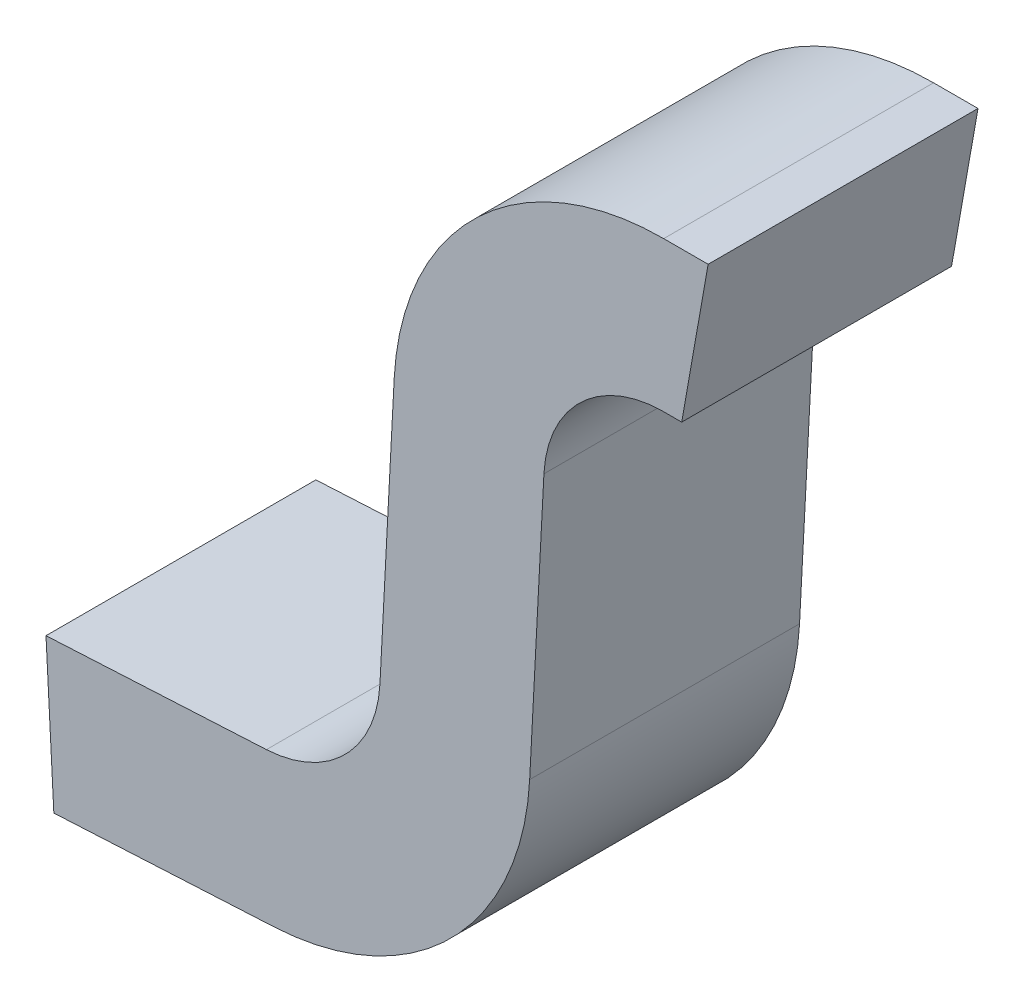
ISO-10303-21;
HEADER;
FILE_DESCRIPTION(('STEP AP214'),'2;1');
FILE_NAME('part.step','',(''),(''),'','','');
FILE_SCHEMA(('AUTOMOTIVE_DESIGN { 1 0 10303 214 1 1 1 1 }'));
ENDSEC;
DATA;
#1=APPLICATION_CONTEXT('core data for automotive mechanical design processes');
#2=APPLICATION_PROTOCOL_DEFINITION('international standard','automotive_design',2000,#1);
#3=PRODUCT_CONTEXT('',#1,'mechanical');
#4=PRODUCT('Part','Part','',(#3));
#5=PRODUCT_RELATED_PRODUCT_CATEGORY('part','',(#4));
#6=PRODUCT_DEFINITION_FORMATION('','',#4);
#7=PRODUCT_DEFINITION_CONTEXT('part definition',#1,'design');
#8=PRODUCT_DEFINITION('design','',#6,#7);
#9=PRODUCT_DEFINITION_SHAPE('','',#8);
#10=(LENGTH_UNIT() NAMED_UNIT(*) SI_UNIT(.MILLI.,.METRE.));
#11=(NAMED_UNIT(*) PLANE_ANGLE_UNIT() SI_UNIT($,.RADIAN.));
#12=(NAMED_UNIT(*) SI_UNIT($,.STERADIAN.) SOLID_ANGLE_UNIT());
#13=UNCERTAINTY_MEASURE_WITH_UNIT(LENGTH_MEASURE(1.E-05),#10,'distance_accuracy_value','');
#14=(GEOMETRIC_REPRESENTATION_CONTEXT(3) GLOBAL_UNCERTAINTY_ASSIGNED_CONTEXT((#13)) GLOBAL_UNIT_ASSIGNED_CONTEXT((#10,
#11,#12)) REPRESENTATION_CONTEXT('',''));
#15=CARTESIAN_POINT('',(0.,0.,0.));
#16=DIRECTION('',(0.,0.,1.));
#17=DIRECTION('',(1.,0.,0.));
#18=AXIS2_PLACEMENT_3D('',#15,#16,#17);
#19=CARTESIAN_POINT('',(0.,0.,-1.1875));
#20=DIRECTION('',(0.,0.,-1.));
#21=DIRECTION('',(-1.,0.,0.));
#22=AXIS2_PLACEMENT_3D('',#19,#20,#21);
#23=PLANE('',#22);
#24=DIRECTION('',(0.0523359562429177,0.998629534754575,0.));
#25=VECTOR('',#24,1.);
#26=CARTESIAN_POINT('',(-0.861573213012,-0.31493822705,-1.1875));
#27=LINE('',#26,#25);
#28=CARTESIAN_POINT('',(-0.849691645319655,-0.0882244098453541,-1.1875));
#29=VERTEX_POINT('',#28);
#30=CARTESIAN_POINT('',(-0.861573213012008,-0.31493822705016,-1.1875));
#31=VERTEX_POINT('',#30);
#32=EDGE_CURVE('E145',#29,#31,#27,.F.);
#33=ORIENTED_EDGE('',*,*,#32,.T.);
#34=CARTESIAN_POINT('',(-0.961436166488,-0.309704631426,-1.1875));
#35=DIRECTION('',(0.,0.,-1.));
#36=DIRECTION('',(-1.,0.,0.));
#37=AXIS2_PLACEMENT_3D('',#34,#35,#36);
#38=CIRCLE('',#37,0.1);
#39=CARTESIAN_POINT('',(-0.956202570863354,-0.40956758490123,-1.1875));
#40=VERTEX_POINT('',#39);
#41=EDGE_CURVE('E181',#31,#40,#38,.T.);
#42=ORIENTED_EDGE('',*,*,#41,.T.);
#43=DIRECTION('',(0.998629534754575,0.0523359562429177,0.));
#44=VECTOR('',#43,1.);
#45=CARTESIAN_POINT('',(-1.14,-0.4192,-1.1875));
#46=LINE('',#45,#44);
#47=CARTESIAN_POINT('',(-1.14000000000012,-0.419200000000006,-1.1875));
#48=VERTEX_POINT('',#47);
#49=EDGE_CURVE('E149',#40,#48,#46,.F.);
#50=ORIENTED_EDGE('',*,*,#49,.T.);
#51=DIRECTION('',(-0.0523359562429177,0.998629534754575,0.));
#52=VECTOR('',#51,1.);
#53=CARTESIAN_POINT('',(-1.13345800547,-0.544028691844,-1.1875));
#54=LINE('',#53,#52);
#55=CARTESIAN_POINT('',(-1.13345800547,-0.544028691843999,-1.1875));
#56=VERTEX_POINT('',#55);
#57=EDGE_CURVE('E155',#48,#56,#54,.F.);
#58=ORIENTED_EDGE('',*,*,#57,.T.);
#59=DIRECTION('',(-0.998629534754575,-0.0523359562429177,0.));
#60=VECTOR('',#59,1.);
#61=CARTESIAN_POINT('',(-0.949660576333,-0.534396276745,-1.1875));
#62=LINE('',#61,#60);
#63=CARTESIAN_POINT('',(-0.949660576333192,-0.53439627674501,-1.1875));
#64=VERTEX_POINT('',#63);
#65=EDGE_CURVE('E160',#56,#64,#62,.F.);
#66=ORIENTED_EDGE('',*,*,#65,.T.);
#67=CARTESIAN_POINT('',(-0.961436166488,-0.309704631426,-1.1875));
#68=DIRECTION('',(0.,0.,-1.));
#69=DIRECTION('',(-1.,0.,0.));
#70=AXIS2_PLACEMENT_3D('',#67,#68,#69);
#71=CIRCLE('',#70,0.225);
#72=CARTESIAN_POINT('',(-0.736744521168336,-0.321480221580316,-1.1875));
#73=VERTEX_POINT('',#72);
#74=EDGE_CURVE('E108',#73,#64,#71,.T.);
#75=ORIENTED_EDGE('',*,*,#74,.F.);
#76=DIRECTION('',(-0.0523359562429177,-0.998629534754575,0.));
#77=VECTOR('',#76,1.);
#78=CARTESIAN_POINT('',(-0.724862953476,-0.09476640437571,-1.1875));
#79=LINE('',#78,#77);
#80=CARTESIAN_POINT('',(-0.724862953475999,-0.0947664043756949,-1.1875));
#81=VERTEX_POINT('',#80);
#82=EDGE_CURVE('E103',#73,#81,#79,.F.);
#83=ORIENTED_EDGE('',*,*,#82,.T.);
#84=CARTESIAN_POINT('',(-0.625,-0.1,-1.1875));
#85=DIRECTION('',(0.,0.,-1.));
#86=DIRECTION('',(-1.,0.,0.));
#87=AXIS2_PLACEMENT_3D('',#84,#85,#86);
#88=CIRCLE('',#87,0.1);
#89=CARTESIAN_POINT('',(-0.625,0.,-1.1875));
#90=VERTEX_POINT('',#89);
#91=EDGE_CURVE('E20',#81,#90,#88,.T.);
#92=ORIENTED_EDGE('',*,*,#91,.T.);
#93=DIRECTION('',(1.,0.,0.));
#94=VECTOR('',#93,1.);
#95=CARTESIAN_POINT('',(-0.61,0.,-1.1875));
#96=LINE('',#95,#94);
#97=CARTESIAN_POINT('',(-0.609999999999862,0.,-1.1875));
#98=VERTEX_POINT('',#97);
#99=EDGE_CURVE('E129',#90,#98,#96,.T.);
#100=ORIENTED_EDGE('',*,*,#99,.T.);
#101=DIRECTION('',(-0.173648177667033,-0.98480775301219,0.));
#102=VECTOR('',#101,1.);
#103=CARTESIAN_POINT('',(-0.587959127411,0.125,-1.1875));
#104=LINE('',#103,#102);
#105=CARTESIAN_POINT('',(-0.587959127411,0.125,-1.1875));
#106=VERTEX_POINT('',#105);
#107=EDGE_CURVE('E134',#98,#106,#104,.F.);
#108=ORIENTED_EDGE('',*,*,#107,.T.);
#109=DIRECTION('',(1.,0.,0.));
#110=VECTOR('',#109,1.);
#111=CARTESIAN_POINT('',(-0.625,0.125,-1.1875));
#112=LINE('',#111,#110);
#113=CARTESIAN_POINT('',(-0.625,0.125,-1.1875));
#114=VERTEX_POINT('',#113);
#115=EDGE_CURVE('E140',#106,#114,#112,.F.);
#116=ORIENTED_EDGE('',*,*,#115,.T.);
#117=CARTESIAN_POINT('',(-0.625,-0.1,-1.1875));
#118=DIRECTION('',(0.,0.,-1.));
#119=DIRECTION('',(-1.,0.,0.));
#120=AXIS2_PLACEMENT_3D('',#117,#118,#119);
#121=CIRCLE('',#120,0.225);
#122=EDGE_CURVE('E142',#29,#114,#121,.T.);
#123=ORIENTED_EDGE('',*,*,#122,.F.);
#124=EDGE_LOOP('',(#33,#42,#50,#58,#66,#75,#83,#92,#100,#108,#116,#123));
#125=FACE_BOUND('',#124,.T.);
#126=ADVANCED_FACE('F17',(#125),#23,.F.);
#127=CARTESIAN_POINT('',(-0.625,-0.1,-1.4125));
#128=DIRECTION('',(0.,0.,-1.));
#129=DIRECTION('',(-1.,0.,0.));
#130=AXIS2_PLACEMENT_3D('',#127,#128,#129);
#131=CYLINDRICAL_SURFACE('',#130,0.1);
#132=ORIENTED_EDGE('',*,*,#91,.F.);
#133=DIRECTION('',(0.,0.,1.));
#134=VECTOR('',#133,1.);
#135=CARTESIAN_POINT('',(-0.724862953476,-0.09476640437571,-1.4125));
#136=LINE('',#135,#134);
#137=CARTESIAN_POINT('',(-0.724862953476004,-0.0947664043757943,-1.4125));
#138=VERTEX_POINT('',#137);
#139=EDGE_CURVE('E112',#81,#138,#136,.F.);
#140=ORIENTED_EDGE('',*,*,#139,.T.);
#141=CARTESIAN_POINT('',(-0.625,-0.1,-1.4125));
#142=DIRECTION('',(0.,0.,-1.));
#143=DIRECTION('',(-1.,0.,0.));
#144=AXIS2_PLACEMENT_3D('',#141,#142,#143);
#145=CIRCLE('',#144,0.1);
#146=CARTESIAN_POINT('',(-0.625,0.,-1.4125));
#147=VERTEX_POINT('',#146);
#148=EDGE_CURVE('E131',#147,#138,#145,.F.);
#149=ORIENTED_EDGE('',*,*,#148,.F.);
#150=DIRECTION('',(0.,0.,1.));
#151=VECTOR('',#150,1.);
#152=CARTESIAN_POINT('',(-0.625,0.,-1.4125));
#153=LINE('',#152,#151);
#154=EDGE_CURVE('E118',#147,#90,#153,.T.);
#155=ORIENTED_EDGE('',*,*,#154,.T.);
#156=EDGE_LOOP('',(#132,#140,#149,#155));
#157=FACE_BOUND('',#156,.T.);
#158=ADVANCED_FACE('F115',(#157),#131,.F.);
#159=CARTESIAN_POINT('',(-0.724862953476,-0.09476640437571,-1.4125));
#160=DIRECTION('',(-0.998629534754575,0.0523359562429177,0.));
#161=DIRECTION('',(-0.0523359562429177,-0.998629534754575,0.));
#162=AXIS2_PLACEMENT_3D('',#159,#160,#161);
#163=PLANE('',#162);
#164=ORIENTED_EDGE('',*,*,#82,.F.);
#165=DIRECTION('',(0.,0.,-1.));
#166=VECTOR('',#165,1.);
#167=CARTESIAN_POINT('',(-0.736744521168186,-0.32148022157999,-1.4125));
#168=LINE('',#167,#166);
#169=CARTESIAN_POINT('',(-0.736744521168099,-0.321480221580105,-1.4125));
#170=VERTEX_POINT('',#169);
#171=EDGE_CURVE('E124',#170,#73,#168,.F.);
#172=ORIENTED_EDGE('',*,*,#171,.F.);
#173=DIRECTION('',(-0.0523359562409312,-0.998629534754679,0.));
#174=VECTOR('',#173,1.);
#175=CARTESIAN_POINT('',(-0.724862953476,-0.09476640437571,-1.4125));
#176=LINE('',#175,#174);
#177=EDGE_CURVE('E122',#138,#170,#176,.T.);
#178=ORIENTED_EDGE('',*,*,#177,.F.);
#179=ORIENTED_EDGE('',*,*,#139,.F.);
#180=EDGE_LOOP('',(#164,#172,#178,#179));
#181=FACE_BOUND('',#180,.T.);
#182=ADVANCED_FACE('F120',(#181),#163,.F.);
#183=CARTESIAN_POINT('',(-0.961436166488,-0.309704631426,-1.4125));
#184=DIRECTION('',(0.,0.,-1.));
#185=DIRECTION('',(-1.,0.,0.));
#186=AXIS2_PLACEMENT_3D('',#183,#184,#185);
#187=CYLINDRICAL_SURFACE('',#186,0.225);
#188=DIRECTION('',(0.,0.,1.));
#189=VECTOR('',#188,1.);
#190=CARTESIAN_POINT('',(-0.949660576333,-0.534396276745,-1.4125));
#191=LINE('',#190,#189);
#192=CARTESIAN_POINT('',(-0.94966057633319,-0.53439627674501,-1.4125));
#193=VERTEX_POINT('',#192);
#194=EDGE_CURVE('E157',#64,#193,#191,.F.);
#195=ORIENTED_EDGE('',*,*,#194,.T.);
#196=CARTESIAN_POINT('',(-0.961436166488,-0.309704631426,-1.4125));
#197=DIRECTION('',(0.,0.,-1.));
#198=DIRECTION('',(-1.,0.,0.));
#199=AXIS2_PLACEMENT_3D('',#196,#197,#198);
#200=CIRCLE('',#199,0.225);
#201=EDGE_CURVE('E173',#170,#193,#200,.T.);
#202=ORIENTED_EDGE('',*,*,#201,.F.);
#203=ORIENTED_EDGE('',*,*,#171,.T.);
#204=ORIENTED_EDGE('',*,*,#74,.T.);
#205=EDGE_LOOP('',(#195,#202,#203,#204));
#206=FACE_BOUND('',#205,.T.);
#207=ADVANCED_FACE('F184',(#206),#187,.T.);
#208=CARTESIAN_POINT('',(-0.949660576333,-0.534396276745,-1.4125));
#209=DIRECTION('',(-0.0523359562429177,0.998629534754575,0.));
#210=DIRECTION('',(-0.998629534754575,-0.0523359562429177,0.));
#211=AXIS2_PLACEMENT_3D('',#208,#209,#210);
#212=PLANE('',#211);
#213=ORIENTED_EDGE('',*,*,#65,.F.);
#214=DIRECTION('',(0.,0.,1.));
#215=VECTOR('',#214,1.);
#216=CARTESIAN_POINT('',(-1.13345800547,-0.544028691844,-1.4125));
#217=LINE('',#216,#215);
#218=CARTESIAN_POINT('',(-1.13345800547,-0.544028691844,-1.4125));
#219=VERTEX_POINT('',#218);
#220=EDGE_CURVE('E152',#56,#219,#217,.F.);
#221=ORIENTED_EDGE('',*,*,#220,.T.);
#222=DIRECTION('',(-0.998629534754574,-0.0523359562429318,0.));
#223=VECTOR('',#222,1.);
#224=CARTESIAN_POINT('',(-0.949660576333,-0.534396276745,-1.4125));
#225=LINE('',#224,#223);
#226=EDGE_CURVE('E176',#193,#219,#225,.T.);
#227=ORIENTED_EDGE('',*,*,#226,.F.);
#228=ORIENTED_EDGE('',*,*,#194,.F.);
#229=EDGE_LOOP('',(#213,#221,#227,#228));
#230=FACE_BOUND('',#229,.T.);
#231=ADVANCED_FACE('F189',(#230),#212,.F.);
#232=CARTESIAN_POINT('',(-1.13345800547,-0.544028691844,-1.4125));
#233=DIRECTION('',(0.998629534754575,0.0523359562429177,0.));
#234=DIRECTION('',(-0.0523359562429177,0.998629534754575,0.));
#235=AXIS2_PLACEMENT_3D('',#232,#233,#234);
#236=PLANE('',#235);
#237=ORIENTED_EDGE('',*,*,#57,.F.);
#238=DIRECTION('',(0.,0.,1.));
#239=VECTOR('',#238,1.);
#240=CARTESIAN_POINT('',(-1.14,-0.4192,-1.4125));
#241=LINE('',#240,#239);
#242=CARTESIAN_POINT('',(-1.14,-0.4192,-1.4125));
#243=VERTEX_POINT('',#242);
#244=EDGE_CURVE('E151',#48,#243,#241,.F.);
#245=ORIENTED_EDGE('',*,*,#244,.T.);
#246=DIRECTION('',(-0.0523359562401418,0.998629534754721,0.));
#247=VECTOR('',#246,1.);
#248=CARTESIAN_POINT('',(-1.13345800547,-0.544028691844,-1.4125));
#249=LINE('',#248,#247);
#250=EDGE_CURVE('E198',#219,#243,#249,.T.);
#251=ORIENTED_EDGE('',*,*,#250,.F.);
#252=ORIENTED_EDGE('',*,*,#220,.F.);
#253=EDGE_LOOP('',(#237,#245,#251,#252));
#254=FACE_BOUND('',#253,.T.);
#255=ADVANCED_FACE('F319',(#254),#236,.F.);
#256=CARTESIAN_POINT('',(-1.14,-0.4192,-1.4125));
#257=DIRECTION('',(0.0523359562429177,-0.998629534754575,0.));
#258=DIRECTION('',(0.998629534754575,0.0523359562429177,0.));
#259=AXIS2_PLACEMENT_3D('',#256,#257,#258);
#260=PLANE('',#259);
#261=ORIENTED_EDGE('',*,*,#49,.F.);
#262=DIRECTION('',(0.,0.,-1.));
#263=VECTOR('',#262,1.);
#264=CARTESIAN_POINT('',(-0.956202570862978,-0.409567584901419,-1.4125));
#265=LINE('',#264,#263);
#266=CARTESIAN_POINT('',(-0.956202570863353,-0.409567584901229,-1.4125));
#267=VERTEX_POINT('',#266);
#268=EDGE_CURVE('E148',#40,#267,#265,.T.);
#269=ORIENTED_EDGE('',*,*,#268,.T.);
#270=DIRECTION('',(0.998629534754574,0.0523359562429318,0.));
#271=VECTOR('',#270,1.);
#272=CARTESIAN_POINT('',(-1.14,-0.4192,-1.4125));
#273=LINE('',#272,#271);
#274=EDGE_CURVE('E172',#243,#267,#273,.T.);
#275=ORIENTED_EDGE('',*,*,#274,.F.);
#276=ORIENTED_EDGE('',*,*,#244,.F.);
#277=EDGE_LOOP('',(#261,#269,#275,#276));
#278=FACE_BOUND('',#277,.T.);
#279=ADVANCED_FACE('F309',(#278),#260,.F.);
#280=CARTESIAN_POINT('',(-0.961436166488,-0.309704631426,-1.4125));
#281=DIRECTION('',(0.,0.,-1.));
#282=DIRECTION('',(-1.,0.,0.));
#283=AXIS2_PLACEMENT_3D('',#280,#281,#282);
#284=CYLINDRICAL_SURFACE('',#283,0.1);
#285=ORIENTED_EDGE('',*,*,#41,.F.);
#286=DIRECTION('',(0.,0.,1.));
#287=VECTOR('',#286,1.);
#288=CARTESIAN_POINT('',(-0.861573213012,-0.31493822705,-1.4125));
#289=LINE('',#288,#287);
#290=CARTESIAN_POINT('',(-0.861573213012003,-0.314938227050056,-1.4125));
#291=VERTEX_POINT('',#290);
#292=EDGE_CURVE('E147',#31,#291,#289,.F.);
#293=ORIENTED_EDGE('',*,*,#292,.T.);
#294=CARTESIAN_POINT('',(-0.961436166488,-0.309704631426,-1.4125));
#295=DIRECTION('',(0.,0.,-1.));
#296=DIRECTION('',(-1.,0.,0.));
#297=AXIS2_PLACEMENT_3D('',#294,#295,#296);
#298=CIRCLE('',#297,0.1);
#299=EDGE_CURVE('E169',#267,#291,#298,.F.);
#300=ORIENTED_EDGE('',*,*,#299,.F.);
#301=ORIENTED_EDGE('',*,*,#268,.F.);
#302=EDGE_LOOP('',(#285,#293,#300,#301));
#303=FACE_BOUND('',#302,.T.);
#304=ADVANCED_FACE('F299',(#303),#284,.F.);
#305=CARTESIAN_POINT('',(-0.861573213012,-0.31493822705,-1.4125));
#306=DIRECTION('',(0.998629534754575,-0.0523359562429177,0.));
#307=DIRECTION('',(0.0523359562429177,0.998629534754575,0.));
#308=AXIS2_PLACEMENT_3D('',#305,#306,#307);
#309=PLANE('',#308);
#310=ORIENTED_EDGE('',*,*,#32,.F.);
#311=DIRECTION('',(0.,0.,-1.));
#312=VECTOR('',#311,1.);
#313=CARTESIAN_POINT('',(-0.84969164531978,-0.0882244098453515,-1.4125));
#314=LINE('',#313,#312);
#315=CARTESIAN_POINT('',(-0.849691645319902,-0.0882244098455748,-1.4125));
#316=VERTEX_POINT('',#315);
#317=EDGE_CURVE('E180',#316,#29,#314,.F.);
#318=ORIENTED_EDGE('',*,*,#317,.F.);
#319=DIRECTION('',(0.052335956240846,0.998629534754684,0.));
#320=VECTOR('',#319,1.);
#321=CARTESIAN_POINT('',(-0.861573213012,-0.31493822705,-1.4125));
#322=LINE('',#321,#320);
#323=EDGE_CURVE('E168',#291,#316,#322,.T.);
#324=ORIENTED_EDGE('',*,*,#323,.F.);
#325=ORIENTED_EDGE('',*,*,#292,.F.);
#326=EDGE_LOOP('',(#310,#318,#324,#325));
#327=FACE_BOUND('',#326,.T.);
#328=ADVANCED_FACE('F289',(#327),#309,.F.);
#329=CARTESIAN_POINT('',(-0.625,-0.1,-1.4125));
#330=DIRECTION('',(0.,0.,-1.));
#331=DIRECTION('',(-1.,0.,0.));
#332=AXIS2_PLACEMENT_3D('',#329,#330,#331);
#333=CYLINDRICAL_SURFACE('',#332,0.225);
#334=DIRECTION('',(0.,0.,-1.));
#335=VECTOR('',#334,1.);
#336=CARTESIAN_POINT('',(-0.625,0.125,-1.4125));
#337=LINE('',#336,#335);
#338=CARTESIAN_POINT('',(-0.625,0.125,-1.4125));
#339=VERTEX_POINT('',#338);
#340=EDGE_CURVE('E137',#114,#339,#337,.T.);
#341=ORIENTED_EDGE('',*,*,#340,.T.);
#342=CARTESIAN_POINT('',(-0.625,-0.1,-1.4125));
#343=DIRECTION('',(0.,0.,-1.));
#344=DIRECTION('',(-1.,0.,0.));
#345=AXIS2_PLACEMENT_3D('',#342,#343,#344);
#346=CIRCLE('',#345,0.225);
#347=EDGE_CURVE('E164',#316,#339,#346,.T.);
#348=ORIENTED_EDGE('',*,*,#347,.F.);
#349=ORIENTED_EDGE('',*,*,#317,.T.);
#350=ORIENTED_EDGE('',*,*,#122,.T.);
#351=EDGE_LOOP('',(#341,#348,#349,#350));
#352=FACE_BOUND('',#351,.T.);
#353=ADVANCED_FACE('F255',(#352),#333,.T.);
#354=CARTESIAN_POINT('',(-0.625,0.125,-1.4125));
#355=DIRECTION('',(0.,-1.,0.));
#356=DIRECTION('',(0.,0.,-1.));
#357=AXIS2_PLACEMENT_3D('',#354,#355,#356);
#358=PLANE('',#357);
#359=ORIENTED_EDGE('',*,*,#115,.F.);
#360=DIRECTION('',(0.,0.,1.));
#361=VECTOR('',#360,1.);
#362=CARTESIAN_POINT('',(-0.587959127411,0.125,-1.4125));
#363=LINE('',#362,#361);
#364=CARTESIAN_POINT('',(-0.587959127411,0.125,-1.4125));
#365=VERTEX_POINT('',#364);
#366=EDGE_CURVE('E136',#106,#365,#363,.F.);
#367=ORIENTED_EDGE('',*,*,#366,.T.);
#368=DIRECTION('',(-1.,0.,0.));
#369=VECTOR('',#368,1.);
#370=CARTESIAN_POINT('',(0.,0.125,-1.4125));
#371=LINE('',#370,#369);
#372=EDGE_CURVE('E167',#339,#365,#371,.F.);
#373=ORIENTED_EDGE('',*,*,#372,.F.);
#374=ORIENTED_EDGE('',*,*,#340,.F.);
#375=EDGE_LOOP('',(#359,#367,#373,#374));
#376=FACE_BOUND('',#375,.T.);
#377=ADVANCED_FACE('F242',(#376),#358,.F.);
#378=CARTESIAN_POINT('',(-0.587959127411,0.125,-1.4125));
#379=DIRECTION('',(-0.98480775301219,0.173648177667033,0.));
#380=DIRECTION('',(-0.173648177667033,-0.98480775301219,0.));
#381=AXIS2_PLACEMENT_3D('',#378,#379,#380);
#382=PLANE('',#381);
#383=ORIENTED_EDGE('',*,*,#366,.F.);
#384=ORIENTED_EDGE('',*,*,#107,.F.);
#385=DIRECTION('',(0.,0.,1.));
#386=VECTOR('',#385,1.);
#387=CARTESIAN_POINT('',(-0.61,0.,-1.4125));
#388=LINE('',#387,#386);
#389=CARTESIAN_POINT('',(-0.61,0.,-1.4125));
#390=VERTEX_POINT('',#389);
#391=EDGE_CURVE('E35',#98,#390,#388,.F.);
#392=ORIENTED_EDGE('',*,*,#391,.T.);
#393=DIRECTION('',(-0.173648177670306,-0.984807753011613,0.));
#394=VECTOR('',#393,1.);
#395=CARTESIAN_POINT('',(-0.587959127411,0.125,-1.4125));
#396=LINE('',#395,#394);
#397=EDGE_CURVE('E26',#365,#390,#396,.T.);
#398=ORIENTED_EDGE('',*,*,#397,.F.);
#399=EDGE_LOOP('',(#383,#384,#392,#398));
#400=FACE_BOUND('',#399,.T.);
#401=ADVANCED_FACE('F244',(#400),#382,.F.);
#402=CARTESIAN_POINT('',(-0.61,0.,-1.4125));
#403=DIRECTION('',(0.,1.,0.));
#404=DIRECTION('',(0.,0.,1.));
#405=AXIS2_PLACEMENT_3D('',#402,#403,#404);
#406=PLANE('',#405);
#407=ORIENTED_EDGE('',*,*,#154,.F.);
#408=DIRECTION('',(-1.,0.,0.));
#409=VECTOR('',#408,1.);
#410=CARTESIAN_POINT('',(0.,0.,-1.4125));
#411=LINE('',#410,#409);
#412=EDGE_CURVE('E11',#390,#147,#411,.T.);
#413=ORIENTED_EDGE('',*,*,#412,.F.);
#414=ORIENTED_EDGE('',*,*,#391,.F.);
#415=ORIENTED_EDGE('',*,*,#99,.F.);
#416=EDGE_LOOP('',(#407,#413,#414,#415));
#417=FACE_BOUND('',#416,.T.);
#418=ADVANCED_FACE('F246',(#417),#406,.F.);
#419=CARTESIAN_POINT('',(0.,0.,-1.4125));
#420=DIRECTION('',(0.,0.,-1.));
#421=DIRECTION('',(-1.,0.,0.));
#422=AXIS2_PLACEMENT_3D('',#419,#420,#421);
#423=PLANE('',#422);
#424=ORIENTED_EDGE('',*,*,#397,.T.);
#425=ORIENTED_EDGE('',*,*,#412,.T.);
#426=ORIENTED_EDGE('',*,*,#148,.T.);
#427=ORIENTED_EDGE('',*,*,#177,.T.);
#428=ORIENTED_EDGE('',*,*,#201,.T.);
#429=ORIENTED_EDGE('',*,*,#226,.T.);
#430=ORIENTED_EDGE('',*,*,#250,.T.);
#431=ORIENTED_EDGE('',*,*,#274,.T.);
#432=ORIENTED_EDGE('',*,*,#299,.T.);
#433=ORIENTED_EDGE('',*,*,#323,.T.);
#434=ORIENTED_EDGE('',*,*,#347,.T.);
#435=ORIENTED_EDGE('',*,*,#372,.T.);
#436=EDGE_LOOP('',(#424,#425,#426,#427,#428,#429,#430,#431,#432,#433,#434,#435));
#437=FACE_BOUND('',#436,.T.);
#438=ADVANCED_FACE('F237',(#437),#423,.T.);
#439=CLOSED_SHELL('',(#126,#158,#182,#207,#231,#255,#279,#304,#328,#353,#377,#401,#418,#438));
#440=MANIFOLD_SOLID_BREP('B1',#439);
#441=ADVANCED_BREP_SHAPE_REPRESENTATION('',(#18,#440),#14);
#442=SHAPE_DEFINITION_REPRESENTATION(#9,#441);
ENDSEC;
END-ISO-10303-21;
